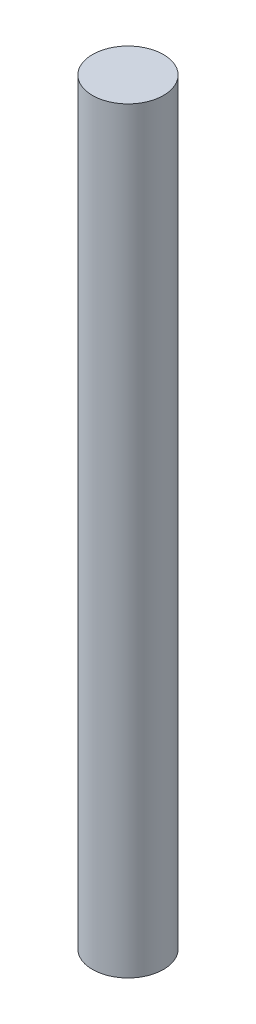
ISO-10303-21;
HEADER;
FILE_DESCRIPTION(('STEP AP214'),'2;1');
FILE_NAME('part.step','',(''),(''),'','','');
FILE_SCHEMA(('AUTOMOTIVE_DESIGN { 1 0 10303 214 1 1 1 1 }'));
ENDSEC;
DATA;
#1=APPLICATION_CONTEXT('core data for automotive mechanical design processes');
#2=APPLICATION_PROTOCOL_DEFINITION('international standard','automotive_design',2000,#1);
#3=PRODUCT_CONTEXT('',#1,'mechanical');
#4=PRODUCT('Part','Part','',(#3));
#5=PRODUCT_RELATED_PRODUCT_CATEGORY('part','',(#4));
#6=PRODUCT_DEFINITION_FORMATION('','',#4);
#7=PRODUCT_DEFINITION_CONTEXT('part definition',#1,'design');
#8=PRODUCT_DEFINITION('design','',#6,#7);
#9=PRODUCT_DEFINITION_SHAPE('','',#8);
#10=(LENGTH_UNIT() NAMED_UNIT(*) SI_UNIT(.MILLI.,.METRE.));
#11=(NAMED_UNIT(*) PLANE_ANGLE_UNIT() SI_UNIT($,.RADIAN.));
#12=(NAMED_UNIT(*) SI_UNIT($,.STERADIAN.) SOLID_ANGLE_UNIT());
#13=UNCERTAINTY_MEASURE_WITH_UNIT(LENGTH_MEASURE(1.E-05),#10,'distance_accuracy_value','');
#14=(GEOMETRIC_REPRESENTATION_CONTEXT(3) GLOBAL_UNCERTAINTY_ASSIGNED_CONTEXT((#13)) GLOBAL_UNIT_ASSIGNED_CONTEXT((#10,
#11,#12)) REPRESENTATION_CONTEXT('',''));
#15=CARTESIAN_POINT('',(0.,0.,0.));
#16=DIRECTION('',(0.,0.,1.));
#17=DIRECTION('',(1.,0.,0.));
#18=AXIS2_PLACEMENT_3D('',#15,#16,#17);
#19=CARTESIAN_POINT('',(0.,50.8,0.));
#20=DIRECTION('',(0.,-1.,0.));
#21=DIRECTION('',(0.,0.,-1.));
#22=AXIS2_PLACEMENT_3D('',#19,#20,#21);
#23=CYLINDRICAL_SURFACE('',#22,4.7625);
#24=CARTESIAN_POINT('',(0.,50.8,0.));
#25=DIRECTION('',(0.,1.,0.));
#26=DIRECTION('',(0.,0.,1.));
#27=AXIS2_PLACEMENT_3D('',#24,#25,#26);
#28=CIRCLE('',#27,4.7625);
#29=CARTESIAN_POINT('',(0.,50.8,4.7625));
#30=VERTEX_POINT('',#29);
#31=EDGE_CURVE('E10',#30,#30,#28,.T.);
#32=ORIENTED_EDGE('',*,*,#31,.F.);
#33=EDGE_LOOP('',(#32));
#34=FACE_BOUND('',#33,.T.);
#35=CARTESIAN_POINT('',(0.,-50.8,0.));
#36=DIRECTION('',(0.,1.,0.));
#37=DIRECTION('',(0.,0.,1.));
#38=AXIS2_PLACEMENT_3D('',#35,#36,#37);
#39=CIRCLE('',#38,4.7625);
#40=CARTESIAN_POINT('',(0.,-50.8,4.7625));
#41=VERTEX_POINT('',#40);
#42=EDGE_CURVE('E33',#41,#41,#39,.T.);
#43=ORIENTED_EDGE('',*,*,#42,.T.);
#44=EDGE_LOOP('',(#43));
#45=FACE_BOUND('',#44,.T.);
#46=ADVANCED_FACE('F30',(#34,#45),#23,.T.);
#47=CARTESIAN_POINT('',(0.,50.8,0.));
#48=DIRECTION('',(0.,1.,0.));
#49=DIRECTION('',(0.,0.,1.));
#50=AXIS2_PLACEMENT_3D('',#47,#48,#49);
#51=PLANE('',#50);
#52=ORIENTED_EDGE('',*,*,#31,.T.);
#53=EDGE_LOOP('',(#52));
#54=FACE_BOUND('',#53,.T.);
#55=ADVANCED_FACE('F45',(#54),#51,.T.);
#56=CARTESIAN_POINT('',(0.,-50.8,0.));
#57=DIRECTION('',(0.,1.,0.));
#58=DIRECTION('',(0.,0.,1.));
#59=AXIS2_PLACEMENT_3D('',#56,#57,#58);
#60=PLANE('',#59);
#61=ORIENTED_EDGE('',*,*,#42,.F.);
#62=EDGE_LOOP('',(#61));
#63=FACE_BOUND('',#62,.T.);
#64=ADVANCED_FACE('F43',(#63),#60,.F.);
#65=CLOSED_SHELL('',(#46,#55,#64));
#66=MANIFOLD_SOLID_BREP('B2',#65);
#67=ADVANCED_BREP_SHAPE_REPRESENTATION('',(#18,#66),#14);
#68=SHAPE_DEFINITION_REPRESENTATION(#9,#67);
ENDSEC;
END-ISO-10303-21;
